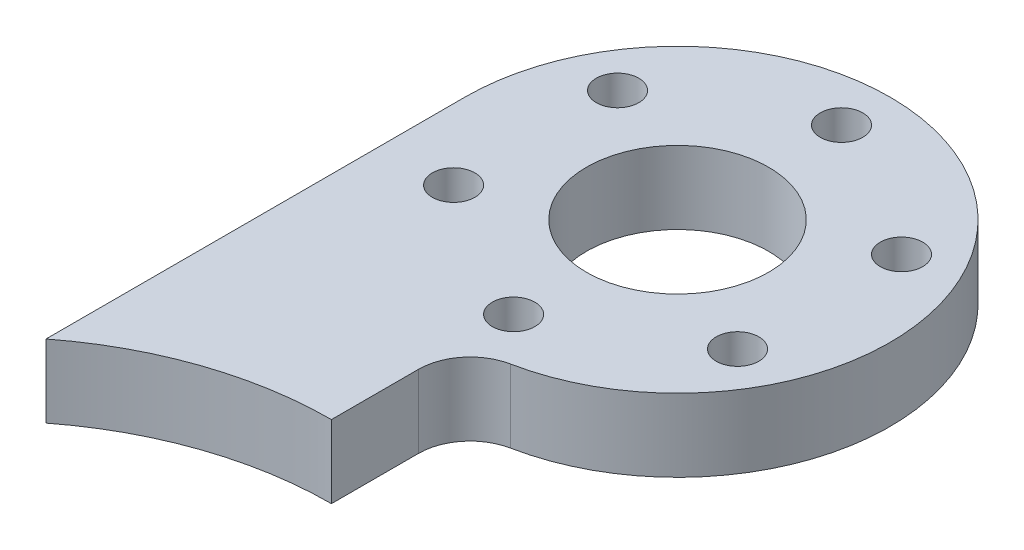
ISO-10303-21;
HEADER;
FILE_DESCRIPTION(('STEP AP214'),'2;1');
FILE_NAME('part.step','',(''),(''),'','','');
FILE_SCHEMA(('AUTOMOTIVE_DESIGN { 1 0 10303 214 1 1 1 1 }'));
ENDSEC;
DATA;
#1=APPLICATION_CONTEXT('core data for automotive mechanical design processes');
#2=APPLICATION_PROTOCOL_DEFINITION('international standard','automotive_design',2000,#1);
#3=PRODUCT_CONTEXT('',#1,'mechanical');
#4=PRODUCT('Part','Part','',(#3));
#5=PRODUCT_RELATED_PRODUCT_CATEGORY('part','',(#4));
#6=PRODUCT_DEFINITION_FORMATION('','',#4);
#7=PRODUCT_DEFINITION_CONTEXT('part definition',#1,'design');
#8=PRODUCT_DEFINITION('design','',#6,#7);
#9=PRODUCT_DEFINITION_SHAPE('','',#8);
#10=(LENGTH_UNIT() NAMED_UNIT(*) SI_UNIT(.MILLI.,.METRE.));
#11=(NAMED_UNIT(*) PLANE_ANGLE_UNIT() SI_UNIT($,.RADIAN.));
#12=(NAMED_UNIT(*) SI_UNIT($,.STERADIAN.) SOLID_ANGLE_UNIT());
#13=UNCERTAINTY_MEASURE_WITH_UNIT(LENGTH_MEASURE(1.E-05),#10,'distance_accuracy_value','');
#14=(GEOMETRIC_REPRESENTATION_CONTEXT(3) GLOBAL_UNCERTAINTY_ASSIGNED_CONTEXT((#13)) GLOBAL_UNIT_ASSIGNED_CONTEXT((#10,
#11,#12)) REPRESENTATION_CONTEXT('',''));
#15=CARTESIAN_POINT('',(0.,0.,0.));
#16=DIRECTION('',(0.,0.,1.));
#17=DIRECTION('',(1.,0.,0.));
#18=AXIS2_PLACEMENT_3D('',#15,#16,#17);
#19=CARTESIAN_POINT('',(0.,6.,0.));
#20=DIRECTION('',(0.,1.,0.));
#21=DIRECTION('',(0.,0.,1.));
#22=AXIS2_PLACEMENT_3D('',#19,#20,#21);
#23=PLANE('',#22);
#24=CARTESIAN_POINT('',(0.,6.,0.));
#25=DIRECTION('',(0.,1.,0.));
#26=DIRECTION('',(0.,0.,1.));
#27=AXIS2_PLACEMENT_3D('',#24,#25,#26);
#28=CIRCLE('',#27,7.5);
#29=CARTESIAN_POINT('',(0.,6.,7.5));
#30=VERTEX_POINT('',#29);
#31=EDGE_CURVE('E315',#30,#30,#28,.T.);
#32=ORIENTED_EDGE('',*,*,#31,.F.);
#33=EDGE_LOOP('',(#32));
#34=FACE_BOUND('',#33,.T.);
#35=CARTESIAN_POINT('',(-11.69134295109,6.,6.74999999999989));
#36=DIRECTION('',(0.,1.,0.));
#37=DIRECTION('',(0.,0.,1.));
#38=AXIS2_PLACEMENT_3D('',#35,#36,#37);
#39=CIRCLE('',#38,1.75);
#40=CARTESIAN_POINT('',(-11.69134295109,6.,8.49999999999989));
#41=VERTEX_POINT('',#40);
#42=EDGE_CURVE('E268',#41,#41,#39,.T.);
#43=ORIENTED_EDGE('',*,*,#42,.F.);
#44=EDGE_LOOP('',(#43));
#45=FACE_BOUND('',#44,.T.);
#46=CARTESIAN_POINT('',(11.6913429510899,6.,6.75000000000005));
#47=DIRECTION('',(0.,1.,0.));
#48=DIRECTION('',(0.,0.,1.));
#49=AXIS2_PLACEMENT_3D('',#46,#47,#48);
#50=CIRCLE('',#49,1.75);
#51=CARTESIAN_POINT('',(11.6913429510899,6.,8.50000000000006));
#52=VERTEX_POINT('',#51);
#53=EDGE_CURVE('E288',#52,#52,#50,.T.);
#54=ORIENTED_EDGE('',*,*,#53,.F.);
#55=EDGE_LOOP('',(#54));
#56=FACE_BOUND('',#55,.T.);
#57=CARTESIAN_POINT('',(0.,6.,-13.5));
#58=DIRECTION('',(0.,1.,0.));
#59=DIRECTION('',(0.,0.,1.));
#60=AXIS2_PLACEMENT_3D('',#57,#58,#59);
#61=CIRCLE('',#60,1.75);
#62=CARTESIAN_POINT('',(0.,6.,-11.75));
#63=VERTEX_POINT('',#62);
#64=EDGE_CURVE('E116',#63,#63,#61,.T.);
#65=ORIENTED_EDGE('',*,*,#64,.F.);
#66=EDGE_LOOP('',(#65));
#67=FACE_BOUND('',#66,.T.);
#68=DIRECTION('',(0.,0.,-1.));
#69=VECTOR('',#68,1.);
#70=CARTESIAN_POINT('',(0.,6.,17.5));
#71=LINE('',#70,#69);
#72=CARTESIAN_POINT('',(0.,6.,28.5));
#73=VERTEX_POINT('',#72);
#74=CARTESIAN_POINT('',(0.,6.,21.3307290077015));
#75=VERTEX_POINT('',#74);
#76=EDGE_CURVE('E108',#73,#75,#71,.T.);
#77=ORIENTED_EDGE('',*,*,#76,.T.);
#78=CARTESIAN_POINT('',(4.25,6.,21.3307290077015));
#79=DIRECTION('',(0.,1.,0.));
#80=DIRECTION('',(0.,0.,1.));
#81=AXIS2_PLACEMENT_3D('',#78,#79,#80);
#82=CIRCLE('',#81,4.25);
#83=CARTESIAN_POINT('',(3.41954022988507,6.,17.1626555234381));
#84=VERTEX_POINT('',#83);
#85=EDGE_CURVE('E11',#75,#84,#82,.F.);
#86=ORIENTED_EDGE('',*,*,#85,.T.);
#87=CARTESIAN_POINT('',(0.,6.,0.));
#88=DIRECTION('',(0.,1.,0.));
#89=DIRECTION('',(0.,0.,1.));
#90=AXIS2_PLACEMENT_3D('',#87,#88,#89);
#91=CIRCLE('',#90,17.5);
#92=CARTESIAN_POINT('',(-17.5,6.,0.));
#93=VERTEX_POINT('',#92);
#94=EDGE_CURVE('E82',#84,#93,#91,.T.);
#95=ORIENTED_EDGE('',*,*,#94,.T.);
#96=DIRECTION('',(0.,0.,1.));
#97=VECTOR('',#96,1.);
#98=CARTESIAN_POINT('',(-17.5,6.,34.505556241596));
#99=LINE('',#98,#97);
#100=CARTESIAN_POINT('',(-17.5,6.,34.505556241596));
#101=VERTEX_POINT('',#100);
#102=EDGE_CURVE('E86',#93,#101,#99,.T.);
#103=ORIENTED_EDGE('',*,*,#102,.T.);
#104=CARTESIAN_POINT('',(0.,6.,57.));
#105=DIRECTION('',(0.,-1.,0.));
#106=DIRECTION('',(0.,0.,1.));
#107=AXIS2_PLACEMENT_3D('',#104,#105,#106);
#108=CIRCLE('',#107,28.5);
#109=EDGE_CURVE('E106',#101,#73,#108,.T.);
#110=ORIENTED_EDGE('',*,*,#109,.T.);
#111=EDGE_LOOP('',(#77,#86,#95,#103,#110));
#112=FACE_BOUND('',#111,.T.);
#113=CARTESIAN_POINT('',(11.6913429510899,6.,-6.74999999999997));
#114=DIRECTION('',(0.,1.,0.));
#115=DIRECTION('',(0.,0.,1.));
#116=AXIS2_PLACEMENT_3D('',#113,#114,#115);
#117=CIRCLE('',#116,1.75);
#118=CARTESIAN_POINT('',(11.6913429510899,6.,-4.99999999999998));
#119=VERTEX_POINT('',#118);
#120=EDGE_CURVE('E294',#119,#119,#117,.T.);
#121=ORIENTED_EDGE('',*,*,#120,.F.);
#122=EDGE_LOOP('',(#121));
#123=FACE_BOUND('',#122,.T.);
#124=CARTESIAN_POINT('',(1.14611941239482E-12,6.,13.5));
#125=DIRECTION('',(0.,1.,0.));
#126=DIRECTION('',(0.,0.,1.));
#127=AXIS2_PLACEMENT_3D('',#124,#125,#126);
#128=CIRCLE('',#127,1.75000000000119);
#129=CARTESIAN_POINT('',(1.14611941239482E-12,6.,15.2500000000012));
#130=VERTEX_POINT('',#129);
#131=EDGE_CURVE('E282',#130,#130,#128,.T.);
#132=ORIENTED_EDGE('',*,*,#131,.F.);
#133=EDGE_LOOP('',(#132));
#134=FACE_BOUND('',#133,.T.);
#135=CARTESIAN_POINT('',(-11.6913429510898,6.,-6.75000000000014));
#136=DIRECTION('',(0.,1.,0.));
#137=DIRECTION('',(0.,0.,1.));
#138=AXIS2_PLACEMENT_3D('',#135,#136,#137);
#139=CIRCLE('',#138,1.75);
#140=CARTESIAN_POINT('',(-11.6913429510898,6.,-5.00000000000014));
#141=VERTEX_POINT('',#140);
#142=EDGE_CURVE('E273',#141,#141,#139,.T.);
#143=ORIENTED_EDGE('',*,*,#142,.F.);
#144=EDGE_LOOP('',(#143));
#145=FACE_BOUND('',#144,.T.);
#146=ADVANCED_FACE('F35',(#34,#45,#56,#67,#112,#123,#134,#145),#23,.T.);
#147=CARTESIAN_POINT('',(0.,0.,0.));
#148=DIRECTION('',(0.,1.,0.));
#149=DIRECTION('',(0.,0.,1.));
#150=AXIS2_PLACEMENT_3D('',#147,#148,#149);
#151=PLANE('',#150);
#152=CARTESIAN_POINT('',(0.,0.,0.));
#153=DIRECTION('',(0.,1.,0.));
#154=DIRECTION('',(0.,0.,1.));
#155=AXIS2_PLACEMENT_3D('',#152,#153,#154);
#156=CIRCLE('',#155,7.5);
#157=CARTESIAN_POINT('',(0.,0.,7.5));
#158=VERTEX_POINT('',#157);
#159=EDGE_CURVE('E39',#158,#158,#156,.T.);
#160=ORIENTED_EDGE('',*,*,#159,.T.);
#161=EDGE_LOOP('',(#160));
#162=FACE_BOUND('',#161,.T.);
#163=CARTESIAN_POINT('',(0.,0.,0.));
#164=DIRECTION('',(0.,1.,0.));
#165=DIRECTION('',(0.,0.,1.));
#166=AXIS2_PLACEMENT_3D('',#163,#164,#165);
#167=CIRCLE('',#166,17.5);
#168=CARTESIAN_POINT('',(3.41954022988506,0.,17.162655523438));
#169=VERTEX_POINT('',#168);
#170=CARTESIAN_POINT('',(-17.5,0.,0.));
#171=VERTEX_POINT('',#170);
#172=EDGE_CURVE('E97',#169,#171,#167,.T.);
#173=ORIENTED_EDGE('',*,*,#172,.F.);
#174=CARTESIAN_POINT('',(4.25,0.,21.3307290077015));
#175=DIRECTION('',(0.,1.,0.));
#176=DIRECTION('',(0.,0.,1.));
#177=AXIS2_PLACEMENT_3D('',#174,#175,#176);
#178=CIRCLE('',#177,4.25);
#179=CARTESIAN_POINT('',(0.,0.,21.3307290077015));
#180=VERTEX_POINT('',#179);
#181=EDGE_CURVE('E44',#169,#180,#178,.T.);
#182=ORIENTED_EDGE('',*,*,#181,.T.);
#183=DIRECTION('',(0.,0.,-1.));
#184=VECTOR('',#183,1.);
#185=CARTESIAN_POINT('',(0.,0.,17.5));
#186=LINE('',#185,#184);
#187=CARTESIAN_POINT('',(0.,0.,28.5));
#188=VERTEX_POINT('',#187);
#189=EDGE_CURVE('E92',#188,#180,#186,.T.);
#190=ORIENTED_EDGE('',*,*,#189,.F.);
#191=CARTESIAN_POINT('',(0.,0.,57.));
#192=DIRECTION('',(0.,-1.,0.));
#193=DIRECTION('',(0.,0.,1.));
#194=AXIS2_PLACEMENT_3D('',#191,#192,#193);
#195=CIRCLE('',#194,28.5);
#196=CARTESIAN_POINT('',(-17.5,0.,34.505556241596));
#197=VERTEX_POINT('',#196);
#198=EDGE_CURVE('E118',#197,#188,#195,.T.);
#199=ORIENTED_EDGE('',*,*,#198,.F.);
#200=DIRECTION('',(0.,0.,1.));
#201=VECTOR('',#200,1.);
#202=CARTESIAN_POINT('',(-17.5,0.,34.505556241596));
#203=LINE('',#202,#201);
#204=EDGE_CURVE('E115',#171,#197,#203,.T.);
#205=ORIENTED_EDGE('',*,*,#204,.F.);
#206=EDGE_LOOP('',(#173,#182,#190,#199,#205));
#207=FACE_BOUND('',#206,.T.);
#208=CARTESIAN_POINT('',(0.,0.,-13.5));
#209=DIRECTION('',(0.,1.,0.));
#210=DIRECTION('',(0.,0.,1.));
#211=AXIS2_PLACEMENT_3D('',#208,#209,#210);
#212=CIRCLE('',#211,1.75);
#213=CARTESIAN_POINT('',(0.,0.,-11.75));
#214=VERTEX_POINT('',#213);
#215=EDGE_CURVE('E297',#214,#214,#212,.T.);
#216=ORIENTED_EDGE('',*,*,#215,.T.);
#217=EDGE_LOOP('',(#216));
#218=FACE_BOUND('',#217,.T.);
#219=CARTESIAN_POINT('',(11.6913429510899,0.,-6.74999999999997));
#220=DIRECTION('',(0.,1.,0.));
#221=DIRECTION('',(0.,0.,1.));
#222=AXIS2_PLACEMENT_3D('',#219,#220,#221);
#223=CIRCLE('',#222,1.75);
#224=CARTESIAN_POINT('',(11.6913429510899,0.,-4.99999999999998));
#225=VERTEX_POINT('',#224);
#226=EDGE_CURVE('E291',#225,#225,#223,.T.);
#227=ORIENTED_EDGE('',*,*,#226,.T.);
#228=EDGE_LOOP('',(#227));
#229=FACE_BOUND('',#228,.T.);
#230=CARTESIAN_POINT('',(11.6913429510899,0.,6.75000000000005));
#231=DIRECTION('',(0.,1.,0.));
#232=DIRECTION('',(0.,0.,1.));
#233=AXIS2_PLACEMENT_3D('',#230,#231,#232);
#234=CIRCLE('',#233,1.75);
#235=CARTESIAN_POINT('',(11.6913429510899,0.,8.50000000000006));
#236=VERTEX_POINT('',#235);
#237=EDGE_CURVE('E285',#236,#236,#234,.T.);
#238=ORIENTED_EDGE('',*,*,#237,.T.);
#239=EDGE_LOOP('',(#238));
#240=FACE_BOUND('',#239,.T.);
#241=CARTESIAN_POINT('',(1.14611941239482E-12,0.,13.5));
#242=DIRECTION('',(0.,1.,0.));
#243=DIRECTION('',(0.,0.,1.));
#244=AXIS2_PLACEMENT_3D('',#241,#242,#243);
#245=CIRCLE('',#244,1.75000000000119);
#246=CARTESIAN_POINT('',(1.14611941239482E-12,0.,15.2500000000012));
#247=VERTEX_POINT('',#246);
#248=EDGE_CURVE('E275',#247,#247,#245,.T.);
#249=ORIENTED_EDGE('',*,*,#248,.T.);
#250=EDGE_LOOP('',(#249));
#251=FACE_BOUND('',#250,.T.);
#252=CARTESIAN_POINT('',(-11.69134295109,0.,6.74999999999989));
#253=DIRECTION('',(0.,1.,0.));
#254=DIRECTION('',(0.,0.,1.));
#255=AXIS2_PLACEMENT_3D('',#252,#253,#254);
#256=CIRCLE('',#255,1.75);
#257=CARTESIAN_POINT('',(-11.69134295109,0.,8.49999999999989));
#258=VERTEX_POINT('',#257);
#259=EDGE_CURVE('E271',#258,#258,#256,.T.);
#260=ORIENTED_EDGE('',*,*,#259,.T.);
#261=EDGE_LOOP('',(#260));
#262=FACE_BOUND('',#261,.T.);
#263=CARTESIAN_POINT('',(-11.6913429510898,0.,-6.75000000000014));
#264=DIRECTION('',(0.,1.,0.));
#265=DIRECTION('',(0.,0.,1.));
#266=AXIS2_PLACEMENT_3D('',#263,#264,#265);
#267=CIRCLE('',#266,1.75);
#268=CARTESIAN_POINT('',(-11.6913429510898,0.,-5.00000000000014));
#269=VERTEX_POINT('',#268);
#270=EDGE_CURVE('E278',#269,#269,#267,.T.);
#271=ORIENTED_EDGE('',*,*,#270,.T.);
#272=EDGE_LOOP('',(#271));
#273=FACE_BOUND('',#272,.T.);
#274=ADVANCED_FACE('F127',(#162,#207,#218,#229,#240,#251,#262,#273),#151,.F.);
#275=CARTESIAN_POINT('',(0.,6.,0.));
#276=DIRECTION('',(0.,-1.,0.));
#277=DIRECTION('',(0.,0.,-1.));
#278=AXIS2_PLACEMENT_3D('',#275,#276,#277);
#279=CYLINDRICAL_SURFACE('',#278,17.5);
#280=ORIENTED_EDGE('',*,*,#94,.F.);
#281=DIRECTION('',(0.,-1.,0.));
#282=VECTOR('',#281,1.);
#283=CARTESIAN_POINT('',(3.41954022988506,6.,17.162655523438));
#284=LINE('',#283,#282);
#285=EDGE_CURVE('E100',#84,#169,#284,.T.);
#286=ORIENTED_EDGE('',*,*,#285,.T.);
#287=ORIENTED_EDGE('',*,*,#172,.T.);
#288=DIRECTION('',(0.,-1.,0.));
#289=VECTOR('',#288,1.);
#290=CARTESIAN_POINT('',(-17.5,6.,0.));
#291=LINE('',#290,#289);
#292=EDGE_CURVE('E95',#93,#171,#291,.T.);
#293=ORIENTED_EDGE('',*,*,#292,.F.);
#294=EDGE_LOOP('',(#280,#286,#287,#293));
#295=FACE_BOUND('',#294,.T.);
#296=ADVANCED_FACE('F96',(#295),#279,.T.);
#297=CARTESIAN_POINT('',(-17.5,6.,34.505556241596));
#298=DIRECTION('',(1.,0.,0.));
#299=DIRECTION('',(0.,0.,-1.));
#300=AXIS2_PLACEMENT_3D('',#297,#298,#299);
#301=PLANE('',#300);
#302=ORIENTED_EDGE('',*,*,#204,.T.);
#303=DIRECTION('',(0.,-1.,0.));
#304=VECTOR('',#303,1.);
#305=CARTESIAN_POINT('',(-17.5,6.,34.505556241596));
#306=LINE('',#305,#304);
#307=EDGE_CURVE('E101',#101,#197,#306,.T.);
#308=ORIENTED_EDGE('',*,*,#307,.F.);
#309=ORIENTED_EDGE('',*,*,#102,.F.);
#310=ORIENTED_EDGE('',*,*,#292,.T.);
#311=EDGE_LOOP('',(#302,#308,#309,#310));
#312=FACE_BOUND('',#311,.T.);
#313=ADVANCED_FACE('F103',(#312),#301,.F.);
#314=CARTESIAN_POINT('',(0.,6.,57.));
#315=DIRECTION('',(0.,-1.,0.));
#316=DIRECTION('',(0.,0.,-1.));
#317=AXIS2_PLACEMENT_3D('',#314,#315,#316);
#318=CYLINDRICAL_SURFACE('',#317,28.5);
#319=ORIENTED_EDGE('',*,*,#198,.T.);
#320=DIRECTION('',(0.,-1.,0.));
#321=VECTOR('',#320,1.);
#322=CARTESIAN_POINT('',(0.,6.,28.5));
#323=LINE('',#322,#321);
#324=EDGE_CURVE('E113',#73,#188,#323,.T.);
#325=ORIENTED_EDGE('',*,*,#324,.F.);
#326=ORIENTED_EDGE('',*,*,#109,.F.);
#327=ORIENTED_EDGE('',*,*,#307,.T.);
#328=EDGE_LOOP('',(#319,#325,#326,#327));
#329=FACE_BOUND('',#328,.T.);
#330=ADVANCED_FACE('F131',(#329),#318,.F.);
#331=CARTESIAN_POINT('',(0.,6.,17.5));
#332=DIRECTION('',(-1.,0.,0.));
#333=DIRECTION('',(0.,0.,1.));
#334=AXIS2_PLACEMENT_3D('',#331,#332,#333);
#335=PLANE('',#334);
#336=ORIENTED_EDGE('',*,*,#189,.T.);
#337=DIRECTION('',(0.,1.,0.));
#338=VECTOR('',#337,1.);
#339=CARTESIAN_POINT('',(0.,6.,21.3307290077015));
#340=LINE('',#339,#338);
#341=EDGE_CURVE('E51',#180,#75,#340,.T.);
#342=ORIENTED_EDGE('',*,*,#341,.T.);
#343=ORIENTED_EDGE('',*,*,#76,.F.);
#344=ORIENTED_EDGE('',*,*,#324,.T.);
#345=EDGE_LOOP('',(#336,#342,#343,#344));
#346=FACE_BOUND('',#345,.T.);
#347=ADVANCED_FACE('F159',(#346),#335,.F.);
#348=CARTESIAN_POINT('',(0.,6.,-13.5));
#349=DIRECTION('',(0.,-1.,0.));
#350=DIRECTION('',(0.,0.,-1.));
#351=AXIS2_PLACEMENT_3D('',#348,#349,#350);
#352=CYLINDRICAL_SURFACE('',#351,1.75);
#353=ORIENTED_EDGE('',*,*,#64,.T.);
#354=EDGE_LOOP('',(#353));
#355=FACE_BOUND('',#354,.T.);
#356=ORIENTED_EDGE('',*,*,#215,.F.);
#357=EDGE_LOOP('',(#356));
#358=FACE_BOUND('',#357,.T.);
#359=ADVANCED_FACE('F156',(#355,#358),#352,.F.);
#360=CARTESIAN_POINT('',(11.6913429510899,6.,-6.74999999999997));
#361=DIRECTION('',(0.,-1.,0.));
#362=DIRECTION('',(0.,0.,-1.));
#363=AXIS2_PLACEMENT_3D('',#360,#361,#362);
#364=CYLINDRICAL_SURFACE('',#363,1.75);
#365=ORIENTED_EDGE('',*,*,#120,.T.);
#366=EDGE_LOOP('',(#365));
#367=FACE_BOUND('',#366,.T.);
#368=ORIENTED_EDGE('',*,*,#226,.F.);
#369=EDGE_LOOP('',(#368));
#370=FACE_BOUND('',#369,.T.);
#371=ADVANCED_FACE('F189',(#367,#370),#364,.F.);
#372=CARTESIAN_POINT('',(11.6913429510899,6.,6.75000000000005));
#373=DIRECTION('',(0.,-1.,0.));
#374=DIRECTION('',(0.,0.,-1.));
#375=AXIS2_PLACEMENT_3D('',#372,#373,#374);
#376=CYLINDRICAL_SURFACE('',#375,1.75);
#377=ORIENTED_EDGE('',*,*,#53,.T.);
#378=EDGE_LOOP('',(#377));
#379=FACE_BOUND('',#378,.T.);
#380=ORIENTED_EDGE('',*,*,#237,.F.);
#381=EDGE_LOOP('',(#380));
#382=FACE_BOUND('',#381,.T.);
#383=ADVANCED_FACE('F196',(#379,#382),#376,.F.);
#384=CARTESIAN_POINT('',(1.14611941239482E-12,6.,13.5));
#385=DIRECTION('',(0.,-1.,0.));
#386=DIRECTION('',(0.,0.,-1.));
#387=AXIS2_PLACEMENT_3D('',#384,#385,#386);
#388=CYLINDRICAL_SURFACE('',#387,1.75000000000119);
#389=ORIENTED_EDGE('',*,*,#131,.T.);
#390=EDGE_LOOP('',(#389));
#391=FACE_BOUND('',#390,.T.);
#392=ORIENTED_EDGE('',*,*,#248,.F.);
#393=EDGE_LOOP('',(#392));
#394=FACE_BOUND('',#393,.T.);
#395=ADVANCED_FACE('F203',(#391,#394),#388,.F.);
#396=CARTESIAN_POINT('',(-11.69134295109,6.,6.74999999999989));
#397=DIRECTION('',(0.,-1.,0.));
#398=DIRECTION('',(0.,0.,-1.));
#399=AXIS2_PLACEMENT_3D('',#396,#397,#398);
#400=CYLINDRICAL_SURFACE('',#399,1.75);
#401=ORIENTED_EDGE('',*,*,#42,.T.);
#402=EDGE_LOOP('',(#401));
#403=FACE_BOUND('',#402,.T.);
#404=ORIENTED_EDGE('',*,*,#259,.F.);
#405=EDGE_LOOP('',(#404));
#406=FACE_BOUND('',#405,.T.);
#407=ADVANCED_FACE('F142',(#403,#406),#400,.F.);
#408=CARTESIAN_POINT('',(-11.6913429510898,6.,-6.75000000000014));
#409=DIRECTION('',(0.,-1.,0.));
#410=DIRECTION('',(0.,0.,-1.));
#411=AXIS2_PLACEMENT_3D('',#408,#409,#410);
#412=CYLINDRICAL_SURFACE('',#411,1.75);
#413=ORIENTED_EDGE('',*,*,#142,.T.);
#414=EDGE_LOOP('',(#413));
#415=FACE_BOUND('',#414,.T.);
#416=ORIENTED_EDGE('',*,*,#270,.F.);
#417=EDGE_LOOP('',(#416));
#418=FACE_BOUND('',#417,.T.);
#419=ADVANCED_FACE('F135',(#415,#418),#412,.F.);
#420=CARTESIAN_POINT('',(4.25,6.,21.3307290077015));
#421=DIRECTION('',(0.,-1.,0.));
#422=DIRECTION('',(0.,0.,-1.));
#423=AXIS2_PLACEMENT_3D('',#420,#421,#422);
#424=CYLINDRICAL_SURFACE('',#423,4.25);
#425=ORIENTED_EDGE('',*,*,#85,.F.);
#426=ORIENTED_EDGE('',*,*,#341,.F.);
#427=ORIENTED_EDGE('',*,*,#181,.F.);
#428=ORIENTED_EDGE('',*,*,#285,.F.);
#429=EDGE_LOOP('',(#425,#426,#427,#428));
#430=FACE_BOUND('',#429,.T.);
#431=ADVANCED_FACE('F37',(#430),#424,.F.);
#432=CARTESIAN_POINT('',(0.,-4.,0.));
#433=DIRECTION('',(0.,1.,0.));
#434=DIRECTION('',(0.,0.,1.));
#435=AXIS2_PLACEMENT_3D('',#432,#433,#434);
#436=CYLINDRICAL_SURFACE('',#435,7.5);
#437=ORIENTED_EDGE('',*,*,#31,.T.);
#438=EDGE_LOOP('',(#437));
#439=FACE_BOUND('',#438,.T.);
#440=ORIENTED_EDGE('',*,*,#159,.F.);
#441=EDGE_LOOP('',(#440));
#442=FACE_BOUND('',#441,.T.);
#443=ADVANCED_FACE('F134',(#439,#442),#436,.F.);
#444=CLOSED_SHELL('',(#146,#274,#296,#313,#330,#347,#359,#371,#383,#395,#407,#419,#431,#443));
#445=MANIFOLD_SOLID_BREP('B2',#444);
#446=ADVANCED_BREP_SHAPE_REPRESENTATION('',(#18,#445),#14);
#447=SHAPE_DEFINITION_REPRESENTATION(#9,#446);
ENDSEC;
END-ISO-10303-21;
